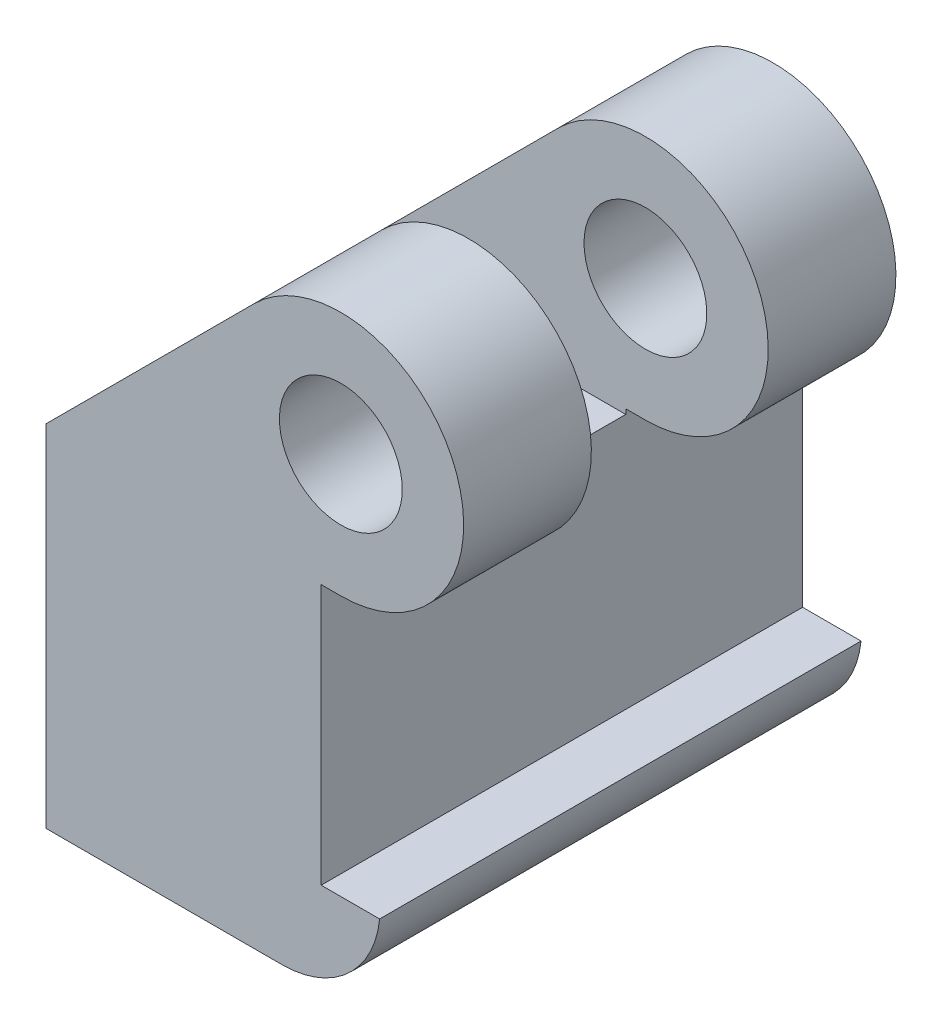
ISO-10303-21;
HEADER;
FILE_DESCRIPTION(('STEP AP214'),'2;1');
FILE_NAME('part.step','',(''),(''),'','','');
FILE_SCHEMA(('AUTOMOTIVE_DESIGN { 1 0 10303 214 1 1 1 1 }'));
ENDSEC;
DATA;
#1=APPLICATION_CONTEXT('core data for automotive mechanical design processes');
#2=APPLICATION_PROTOCOL_DEFINITION('international standard','automotive_design',2000,#1);
#3=PRODUCT_CONTEXT('',#1,'mechanical');
#4=PRODUCT('Part','Part','',(#3));
#5=PRODUCT_RELATED_PRODUCT_CATEGORY('part','',(#4));
#6=PRODUCT_DEFINITION_FORMATION('','',#4);
#7=PRODUCT_DEFINITION_CONTEXT('part definition',#1,'design');
#8=PRODUCT_DEFINITION('design','',#6,#7);
#9=PRODUCT_DEFINITION_SHAPE('','',#8);
#10=(LENGTH_UNIT() NAMED_UNIT(*) SI_UNIT(.MILLI.,.METRE.));
#11=(NAMED_UNIT(*) PLANE_ANGLE_UNIT() SI_UNIT($,.RADIAN.));
#12=(NAMED_UNIT(*) SI_UNIT($,.STERADIAN.) SOLID_ANGLE_UNIT());
#13=UNCERTAINTY_MEASURE_WITH_UNIT(LENGTH_MEASURE(1.E-05),#10,'distance_accuracy_value','');
#14=(GEOMETRIC_REPRESENTATION_CONTEXT(3) GLOBAL_UNCERTAINTY_ASSIGNED_CONTEXT((#13)) GLOBAL_UNIT_ASSIGNED_CONTEXT((#10,
#11,#12)) REPRESENTATION_CONTEXT('',''));
#15=CARTESIAN_POINT('',(0.,0.,0.));
#16=DIRECTION('',(0.,0.,1.));
#17=DIRECTION('',(1.,0.,0.));
#18=AXIS2_PLACEMENT_3D('',#15,#16,#17);
#19=CARTESIAN_POINT('',(-3.302,-7.112,5.08));
#20=DIRECTION('',(0.,1.,0.));
#21=DIRECTION('',(1.,0.,0.));
#22=AXIS2_PLACEMENT_3D('',#19,#20,#21);
#23=PLANE('',#22);
#24=DIRECTION('',(-1.,0.,0.));
#25=VECTOR('',#24,1.);
#26=CARTESIAN_POINT('',(-3.302,-7.112,5.08));
#27=LINE('',#26,#25);
#28=CARTESIAN_POINT('',(-4.572,-7.112,5.08));
#29=VERTEX_POINT('',#28);
#30=CARTESIAN_POINT('',(-7.62,-7.112,5.08));
#31=VERTEX_POINT('',#30);
#32=EDGE_CURVE('E537',#29,#31,#27,.T.);
#33=ORIENTED_EDGE('',*,*,#32,.T.);
#34=DIRECTION('',(0.,0.,-1.));
#35=VECTOR('',#34,1.);
#36=CARTESIAN_POINT('',(-7.62,-7.112,5.08));
#37=LINE('',#36,#35);
#38=CARTESIAN_POINT('',(-7.62,-7.112,3.556));
#39=VERTEX_POINT('',#38);
#40=EDGE_CURVE('E689',#31,#39,#37,.T.);
#41=ORIENTED_EDGE('',*,*,#40,.T.);
#42=DIRECTION('',(-1.,0.,0.));
#43=VECTOR('',#42,1.);
#44=CARTESIAN_POINT('',(-7.62,-7.11200000000001,3.556));
#45=LINE('',#44,#43);
#46=CARTESIAN_POINT('',(-6.0325,-7.11200000000001,3.556));
#47=VERTEX_POINT('',#46);
#48=EDGE_CURVE('E565',#47,#39,#45,.T.);
#49=ORIENTED_EDGE('',*,*,#48,.F.);
#50=CARTESIAN_POINT('',(-5.23875,-7.11200000000001,3.556));
#51=DIRECTION('',(0.,-1.,0.));
#52=DIRECTION('',(0.,0.,-1.));
#53=AXIS2_PLACEMENT_3D('',#50,#51,#52);
#54=CIRCLE('',#53,0.79375);
#55=CARTESIAN_POINT('',(-4.572,-7.11200000000001,3.98667795392845));
#56=VERTEX_POINT('',#55);
#57=EDGE_CURVE('E562',#56,#47,#54,.T.);
#58=ORIENTED_EDGE('',*,*,#57,.F.);
#59=DIRECTION('',(0.,0.,-1.));
#60=VECTOR('',#59,1.);
#61=CARTESIAN_POINT('',(-4.572,-7.112,5.08));
#62=LINE('',#61,#60);
#63=EDGE_CURVE('E706',#29,#56,#62,.T.);
#64=ORIENTED_EDGE('',*,*,#63,.F.);
#65=EDGE_LOOP('',(#33,#41,#49,#58,#64));
#66=FACE_BOUND('',#65,.T.);
#67=ADVANCED_FACE('F372',(#66),#23,.F.);
#68=CARTESIAN_POINT('',(-7.62,-5.842,5.08));
#69=DIRECTION('',(1.,0.,0.));
#70=DIRECTION('',(0.,-1.,0.));
#71=AXIS2_PLACEMENT_3D('',#68,#69,#70);
#72=PLANE('',#71);
#73=DIRECTION('',(0.,-1.,0.));
#74=VECTOR('',#73,1.);
#75=CARTESIAN_POINT('',(-7.62,-5.52450000000001,0.380999999999999));
#76=LINE('',#75,#74);
#77=CARTESIAN_POINT('',(-7.62,-5.52450000000001,0.380999999999999));
#78=VERTEX_POINT('',#77);
#79=CARTESIAN_POINT('',(-7.62,-7.11200000000001,0.380999999999999));
#80=VERTEX_POINT('',#79);
#81=EDGE_CURVE('E597',#78,#80,#76,.T.);
#82=ORIENTED_EDGE('',*,*,#81,.F.);
#83=DIRECTION('',(0.,0.,-1.));
#84=VECTOR('',#83,1.);
#85=CARTESIAN_POINT('',(-7.62,-5.52450000000001,3.556));
#86=LINE('',#85,#84);
#87=CARTESIAN_POINT('',(-7.62,-5.52450000000001,3.556));
#88=VERTEX_POINT('',#87);
#89=EDGE_CURVE('E568',#88,#78,#86,.T.);
#90=ORIENTED_EDGE('',*,*,#89,.F.);
#91=DIRECTION('',(0.,-1.,0.));
#92=VECTOR('',#91,1.);
#93=CARTESIAN_POINT('',(-7.62,-5.52450000000001,3.556));
#94=LINE('',#93,#92);
#95=EDGE_CURVE('E585',#88,#39,#94,.T.);
#96=ORIENTED_EDGE('',*,*,#95,.T.);
#97=ORIENTED_EDGE('',*,*,#40,.F.);
#98=DIRECTION('',(0.,1.,0.));
#99=VECTOR('',#98,1.);
#100=CARTESIAN_POINT('',(-7.62,-7.112,5.08));
#101=LINE('',#100,#99);
#102=CARTESIAN_POINT('',(-7.62,-2.58093596973274,5.08));
#103=VERTEX_POINT('',#102);
#104=EDGE_CURVE('E663',#31,#103,#101,.T.);
#105=ORIENTED_EDGE('',*,*,#104,.T.);
#106=DIRECTION('',(0.,0.,-1.));
#107=VECTOR('',#106,1.);
#108=CARTESIAN_POINT('',(-7.62,-2.58093596973274,5.08));
#109=LINE('',#108,#107);
#110=CARTESIAN_POINT('',(-7.62,-2.58093596973274,3.429));
#111=VERTEX_POINT('',#110);
#112=EDGE_CURVE('E685',#103,#111,#109,.T.);
#113=ORIENTED_EDGE('',*,*,#112,.T.);
#114=DIRECTION('',(0.,-1.,0.));
#115=VECTOR('',#114,1.);
#116=CARTESIAN_POINT('',(-7.62,-5.842,3.429));
#117=LINE('',#116,#115);
#118=CARTESIAN_POINT('',(-7.62,-2.667,3.429));
#119=VERTEX_POINT('',#118);
#120=EDGE_CURVE('E631',#111,#119,#117,.T.);
#121=ORIENTED_EDGE('',*,*,#120,.T.);
#122=DIRECTION('',(0.,0.,-1.));
#123=VECTOR('',#122,1.);
#124=CARTESIAN_POINT('',(-7.62,-2.667,5.08));
#125=LINE('',#124,#123);
#126=CARTESIAN_POINT('',(-7.62,-2.667,1.143));
#127=VERTEX_POINT('',#126);
#128=EDGE_CURVE('E692',#119,#127,#125,.T.);
#129=ORIENTED_EDGE('',*,*,#128,.T.);
#130=DIRECTION('',(0.,-1.,0.));
#131=VECTOR('',#130,1.);
#132=CARTESIAN_POINT('',(-7.62,-5.842,1.143));
#133=LINE('',#132,#131);
#134=CARTESIAN_POINT('',(-7.62,-2.58093596973274,1.143));
#135=VERTEX_POINT('',#134);
#136=EDGE_CURVE('E643',#135,#127,#133,.T.);
#137=ORIENTED_EDGE('',*,*,#136,.F.);
#138=CARTESIAN_POINT('',(-7.62,-2.58093596973274,-0.508));
#139=VERTEX_POINT('',#138);
#140=EDGE_CURVE('E684',#135,#139,#109,.T.);
#141=ORIENTED_EDGE('',*,*,#140,.T.);
#142=DIRECTION('',(0.,-1.,0.));
#143=VECTOR('',#142,1.);
#144=CARTESIAN_POINT('',(-7.62,-5.842,-0.508));
#145=LINE('',#144,#143);
#146=CARTESIAN_POINT('',(-7.62,-2.667,-0.508));
#147=VERTEX_POINT('',#146);
#148=EDGE_CURVE('E614',#139,#147,#145,.T.);
#149=ORIENTED_EDGE('',*,*,#148,.T.);
#150=DIRECTION('',(0.,0.,-1.));
#151=VECTOR('',#150,1.);
#152=CARTESIAN_POINT('',(-7.62,-2.667,5.08));
#153=LINE('',#152,#151);
#154=CARTESIAN_POINT('',(-7.62,-2.667,-1.143));
#155=VERTEX_POINT('',#154);
#156=EDGE_CURVE('E602',#147,#155,#153,.T.);
#157=ORIENTED_EDGE('',*,*,#156,.T.);
#158=DIRECTION('',(0.,1.,0.));
#159=VECTOR('',#158,1.);
#160=CARTESIAN_POINT('',(-7.62,-10.0622750118298,-1.143));
#161=LINE('',#160,#159);
#162=CARTESIAN_POINT('',(-7.62,-7.112,-1.143));
#163=VERTEX_POINT('',#162);
#164=EDGE_CURVE('E652',#163,#155,#161,.T.);
#165=ORIENTED_EDGE('',*,*,#164,.F.);
#166=EDGE_CURVE('E688',#80,#163,#37,.T.);
#167=ORIENTED_EDGE('',*,*,#166,.F.);
#168=EDGE_LOOP('',(#82,#90,#96,#97,#105,#113,#121,#129,#137,#141,#149,#157,#165,#167));
#169=FACE_BOUND('',#168,.T.);
#170=ADVANCED_FACE('F754',(#169),#72,.F.);
#171=CARTESIAN_POINT('',(-5.23875,-7.11200000000001,0.380999999999999));
#172=DIRECTION('',(0.,-1.,0.));
#173=DIRECTION('',(0.,0.,1.));
#174=AXIS2_PLACEMENT_3D('',#171,#172,#173);
#175=CIRCLE('',#174,0.79375);
#176=CARTESIAN_POINT('',(-6.0325,-7.11200000000001,0.380999999999999));
#177=VERTEX_POINT('',#176);
#178=CARTESIAN_POINT('',(-4.572,-7.11200000000001,-0.0496779539284517));
#179=VERTEX_POINT('',#178);
#180=EDGE_CURVE('E559',#177,#179,#175,.T.);
#181=ORIENTED_EDGE('',*,*,#180,.F.);
#182=DIRECTION('',(1.,0.,0.));
#183=VECTOR('',#182,1.);
#184=CARTESIAN_POINT('',(-6.0325,-7.11200000000001,0.380999999999999));
#185=LINE('',#184,#183);
#186=EDGE_CURVE('E543',#80,#177,#185,.T.);
#187=ORIENTED_EDGE('',*,*,#186,.F.);
#188=ORIENTED_EDGE('',*,*,#166,.T.);
#189=DIRECTION('',(-1.,0.,0.));
#190=VECTOR('',#189,1.);
#191=CARTESIAN_POINT('',(-3.302,-7.112,-1.143));
#192=LINE('',#191,#190);
#193=CARTESIAN_POINT('',(-4.572,-7.112,-1.143));
#194=VERTEX_POINT('',#193);
#195=EDGE_CURVE('E657',#194,#163,#192,.T.);
#196=ORIENTED_EDGE('',*,*,#195,.F.);
#197=DIRECTION('',(0.,0.,-1.));
#198=VECTOR('',#197,1.);
#199=CARTESIAN_POINT('',(-4.572,-7.112,5.08));
#200=LINE('',#199,#198);
#201=EDGE_CURVE('E701',#179,#194,#200,.T.);
#202=ORIENTED_EDGE('',*,*,#201,.F.);
#203=EDGE_LOOP('',(#181,#187,#188,#196,#202));
#204=FACE_BOUND('',#203,.T.);
#205=ADVANCED_FACE('F765',(#204),#23,.F.);
#206=CARTESIAN_POINT('',(-4.064,-4.318,5.08));
#207=DIRECTION('',(-1.,0.,0.));
#208=DIRECTION('',(0.,0.,1.));
#209=AXIS2_PLACEMENT_3D('',#206,#207,#208);
#210=PLANE('',#209);
#211=DIRECTION('',(0.,0.,1.));
#212=VECTOR('',#211,1.);
#213=CARTESIAN_POINT('',(-4.064,-2.667,5.08));
#214=LINE('',#213,#212);
#215=CARTESIAN_POINT('',(-4.064,-2.667,-1.143));
#216=VERTEX_POINT('',#215);
#217=CARTESIAN_POINT('',(-4.064,-2.667,-0.508));
#218=VERTEX_POINT('',#217);
#219=EDGE_CURVE('E605',#216,#218,#214,.T.);
#220=ORIENTED_EDGE('',*,*,#219,.T.);
#221=DIRECTION('',(0.,1.,0.));
#222=VECTOR('',#221,1.);
#223=CARTESIAN_POINT('',(-4.064,-4.318,-0.508));
#224=LINE('',#223,#222);
#225=CARTESIAN_POINT('',(-4.064,-2.6035,-0.508));
#226=VERTEX_POINT('',#225);
#227=EDGE_CURVE('E617',#218,#226,#224,.T.);
#228=ORIENTED_EDGE('',*,*,#227,.T.);
#229=DIRECTION('',(0.,0.,-1.));
#230=VECTOR('',#229,1.);
#231=CARTESIAN_POINT('',(-4.064,-2.6035,5.08));
#232=LINE('',#231,#230);
#233=CARTESIAN_POINT('',(-4.064,-2.6035,1.143));
#234=VERTEX_POINT('',#233);
#235=EDGE_CURVE('E674',#234,#226,#232,.T.);
#236=ORIENTED_EDGE('',*,*,#235,.F.);
#237=DIRECTION('',(0.,1.,0.));
#238=VECTOR('',#237,1.);
#239=CARTESIAN_POINT('',(-4.064,-4.318,1.143));
#240=LINE('',#239,#238);
#241=CARTESIAN_POINT('',(-4.064,-2.667,1.143));
#242=VERTEX_POINT('',#241);
#243=EDGE_CURVE('E646',#242,#234,#240,.T.);
#244=ORIENTED_EDGE('',*,*,#243,.F.);
#245=DIRECTION('',(0.,0.,1.));
#246=VECTOR('',#245,1.);
#247=CARTESIAN_POINT('',(-4.064,-2.667,5.08));
#248=LINE('',#247,#246);
#249=CARTESIAN_POINT('',(-4.064,-2.667,3.429));
#250=VERTEX_POINT('',#249);
#251=EDGE_CURVE('E649',#242,#250,#248,.T.);
#252=ORIENTED_EDGE('',*,*,#251,.T.);
#253=DIRECTION('',(0.,1.,0.));
#254=VECTOR('',#253,1.);
#255=CARTESIAN_POINT('',(-4.064,-4.318,3.429));
#256=LINE('',#255,#254);
#257=CARTESIAN_POINT('',(-4.064,-2.6035,3.429));
#258=VERTEX_POINT('',#257);
#259=EDGE_CURVE('E634',#250,#258,#256,.T.);
#260=ORIENTED_EDGE('',*,*,#259,.T.);
#261=CARTESIAN_POINT('',(-4.064,-2.6035,5.08));
#262=VERTEX_POINT('',#261);
#263=EDGE_CURVE('E535',#262,#258,#232,.T.);
#264=ORIENTED_EDGE('',*,*,#263,.F.);
#265=DIRECTION('',(0.,-1.,0.));
#266=VECTOR('',#265,1.);
#267=CARTESIAN_POINT('',(-4.064,-4.318,5.08));
#268=LINE('',#267,#266);
#269=CARTESIAN_POINT('',(-4.064,-5.969,5.08));
#270=VERTEX_POINT('',#269);
#271=EDGE_CURVE('E528',#262,#270,#268,.T.);
#272=ORIENTED_EDGE('',*,*,#271,.T.);
#273=DIRECTION('',(0.,0.,1.));
#274=VECTOR('',#273,1.);
#275=CARTESIAN_POINT('',(-4.064,-5.969,-1.143));
#276=LINE('',#275,#274);
#277=CARTESIAN_POINT('',(-4.064,-5.969,-1.143));
#278=VERTEX_POINT('',#277);
#279=EDGE_CURVE('E531',#278,#270,#276,.T.);
#280=ORIENTED_EDGE('',*,*,#279,.F.);
#281=DIRECTION('',(0.,-1.,0.));
#282=VECTOR('',#281,1.);
#283=CARTESIAN_POINT('',(-4.064,-4.318,-1.143));
#284=LINE('',#283,#282);
#285=EDGE_CURVE('E655',#216,#278,#284,.T.);
#286=ORIENTED_EDGE('',*,*,#285,.F.);
#287=EDGE_LOOP('',(#220,#228,#236,#244,#252,#260,#264,#272,#280,#286));
#288=FACE_BOUND('',#287,.T.);
#289=ADVANCED_FACE('F374',(#288),#210,.F.);
#290=CARTESIAN_POINT('',(-4.93253201513365,0.106532015133637,5.08));
#291=DIRECTION('',(0.707106781186551,-0.707106781186544,0.));
#292=DIRECTION('',(-0.707106781186544,-0.707106781186551,0.));
#293=AXIS2_PLACEMENT_3D('',#290,#291,#292);
#294=PLANE('',#293);
#295=DIRECTION('',(-0.707106781186544,-0.707106781186551,0.));
#296=VECTOR('',#295,1.);
#297=CARTESIAN_POINT('',(-4.93253201513365,0.106532015133637,-0.508));
#298=LINE('',#297,#296);
#299=CARTESIAN_POINT('',(-4.93253201513365,0.106532015133638,-0.508));
#300=VERTEX_POINT('',#299);
#301=EDGE_CURVE('E612',#300,#139,#298,.T.);
#302=ORIENTED_EDGE('',*,*,#301,.T.);
#303=ORIENTED_EDGE('',*,*,#140,.F.);
#304=DIRECTION('',(-0.707106781186544,-0.707106781186551,0.));
#305=VECTOR('',#304,1.);
#306=CARTESIAN_POINT('',(-4.93253201513365,0.106532015133637,1.143));
#307=LINE('',#306,#305);
#308=CARTESIAN_POINT('',(-4.93253201513365,0.106532015133638,1.143));
#309=VERTEX_POINT('',#308);
#310=EDGE_CURVE('E641',#309,#135,#307,.T.);
#311=ORIENTED_EDGE('',*,*,#310,.F.);
#312=DIRECTION('',(0.,0.,-1.));
#313=VECTOR('',#312,1.);
#314=CARTESIAN_POINT('',(-4.93253201513365,0.106532015133637,5.08));
#315=LINE('',#314,#313);
#316=EDGE_CURVE('E680',#309,#300,#315,.T.);
#317=ORIENTED_EDGE('',*,*,#316,.T.);
#318=EDGE_LOOP('',(#302,#303,#311,#317));
#319=FACE_BOUND('',#318,.T.);
#320=ADVANCED_FACE('F813',(#319),#294,.F.);
#321=CARTESIAN_POINT('',(-3.81,-1.016,5.08));
#322=DIRECTION('',(0.,0.,-1.));
#323=DIRECTION('',(-1.,0.,0.));
#324=AXIS2_PLACEMENT_3D('',#321,#322,#323);
#325=CYLINDRICAL_SURFACE('',#324,1.5875);
#326=CARTESIAN_POINT('',(-3.81,-1.016,-0.508));
#327=DIRECTION('',(0.,0.,1.));
#328=DIRECTION('',(-1.,0.,0.));
#329=AXIS2_PLACEMENT_3D('',#326,#327,#328);
#330=CIRCLE('',#329,1.5875);
#331=CARTESIAN_POINT('',(-3.81,-2.6035,-0.508));
#332=VERTEX_POINT('',#331);
#333=EDGE_CURVE('E610',#332,#300,#330,.T.);
#334=ORIENTED_EDGE('',*,*,#333,.T.);
#335=ORIENTED_EDGE('',*,*,#316,.F.);
#336=CARTESIAN_POINT('',(-3.81,-1.016,1.143));
#337=DIRECTION('',(0.,0.,1.));
#338=DIRECTION('',(0.,-1.,0.));
#339=AXIS2_PLACEMENT_3D('',#336,#337,#338);
#340=CIRCLE('',#339,1.5875);
#341=CARTESIAN_POINT('',(-3.81,-2.6035,1.143));
#342=VERTEX_POINT('',#341);
#343=EDGE_CURVE('E639',#342,#309,#340,.T.);
#344=ORIENTED_EDGE('',*,*,#343,.F.);
#345=DIRECTION('',(0.,0.,-1.));
#346=VECTOR('',#345,1.);
#347=CARTESIAN_POINT('',(-3.81,-2.6035,5.08));
#348=LINE('',#347,#346);
#349=EDGE_CURVE('E676',#342,#332,#348,.T.);
#350=ORIENTED_EDGE('',*,*,#349,.T.);
#351=EDGE_LOOP('',(#334,#335,#344,#350));
#352=FACE_BOUND('',#351,.T.);
#353=ADVANCED_FACE('F818',(#352),#325,.T.);
#354=CARTESIAN_POINT('',(-4.064,-2.6035,5.08));
#355=DIRECTION('',(0.,1.,0.));
#356=DIRECTION('',(0.,0.,-1.));
#357=AXIS2_PLACEMENT_3D('',#354,#355,#356);
#358=PLANE('',#357);
#359=DIRECTION('',(1.,0.,0.));
#360=VECTOR('',#359,1.);
#361=CARTESIAN_POINT('',(-4.064,-2.6035,-0.508));
#362=LINE('',#361,#360);
#363=EDGE_CURVE('E608',#226,#332,#362,.T.);
#364=ORIENTED_EDGE('',*,*,#363,.T.);
#365=ORIENTED_EDGE('',*,*,#349,.F.);
#366=DIRECTION('',(1.,0.,0.));
#367=VECTOR('',#366,1.);
#368=CARTESIAN_POINT('',(-4.064,-2.6035,1.143));
#369=LINE('',#368,#367);
#370=EDGE_CURVE('E637',#234,#342,#369,.T.);
#371=ORIENTED_EDGE('',*,*,#370,.F.);
#372=ORIENTED_EDGE('',*,*,#235,.T.);
#373=EDGE_LOOP('',(#364,#365,#371,#372));
#374=FACE_BOUND('',#373,.T.);
#375=ADVANCED_FACE('F784',(#374),#358,.F.);
#376=CARTESIAN_POINT('',(-3.81,-1.016,5.08));
#377=DIRECTION('',(0.,0.,-1.));
#378=DIRECTION('',(-1.,0.,0.));
#379=AXIS2_PLACEMENT_3D('',#376,#377,#378);
#380=CYLINDRICAL_SURFACE('',#379,0.793750000000003);
#381=CARTESIAN_POINT('',(-3.81,-1.016,1.143));
#382=DIRECTION('',(0.,0.,1.));
#383=DIRECTION('',(0.,-1.,0.));
#384=AXIS2_PLACEMENT_3D('',#381,#382,#383);
#385=CIRCLE('',#384,0.793750000000003);
#386=CARTESIAN_POINT('',(-3.81,-1.80975,1.143));
#387=VERTEX_POINT('',#386);
#388=EDGE_CURVE('E636',#387,#387,#385,.T.);
#389=ORIENTED_EDGE('',*,*,#388,.T.);
#390=EDGE_LOOP('',(#389));
#391=FACE_BOUND('',#390,.T.);
#392=CARTESIAN_POINT('',(-3.81,-1.016,-0.508));
#393=DIRECTION('',(0.,0.,1.));
#394=DIRECTION('',(-1.,0.,0.));
#395=AXIS2_PLACEMENT_3D('',#392,#393,#394);
#396=CIRCLE('',#395,0.793750000000003);
#397=CARTESIAN_POINT('',(-4.60375,-1.016,-0.508));
#398=VERTEX_POINT('',#397);
#399=EDGE_CURVE('E607',#398,#398,#396,.T.);
#400=ORIENTED_EDGE('',*,*,#399,.F.);
#401=EDGE_LOOP('',(#400));
#402=FACE_BOUND('',#401,.T.);
#403=ADVANCED_FACE('F825',(#391,#402),#380,.F.);
#404=CARTESIAN_POINT('',(-7.62,-10.0622750118298,-1.143));
#405=DIRECTION('',(0.,0.,1.));
#406=DIRECTION('',(0.,1.,0.));
#407=AXIS2_PLACEMENT_3D('',#404,#405,#406);
#408=PLANE('',#407);
#409=ORIENTED_EDGE('',*,*,#285,.T.);
#410=DIRECTION('',(1.,0.,0.));
#411=VECTOR('',#410,1.);
#412=CARTESIAN_POINT('',(-4.064,-5.969,-1.143));
#413=LINE('',#412,#411);
#414=CARTESIAN_POINT('',(-3.30836595487459,-5.969,-1.143));
#415=VERTEX_POINT('',#414);
#416=EDGE_CURVE('E542',#278,#415,#413,.T.);
#417=ORIENTED_EDGE('',*,*,#416,.T.);
#418=CARTESIAN_POINT('',(-4.572,-5.842,-1.143));
#419=DIRECTION('',(0.,0.,-1.));
#420=DIRECTION('',(0.,1.,0.));
#421=AXIS2_PLACEMENT_3D('',#418,#419,#420);
#422=CIRCLE('',#421,1.27);
#423=EDGE_CURVE('E744',#194,#415,#422,.F.);
#424=ORIENTED_EDGE('',*,*,#423,.F.);
#425=ORIENTED_EDGE('',*,*,#195,.T.);
#426=ORIENTED_EDGE('',*,*,#164,.T.);
#427=DIRECTION('',(1.,0.,0.));
#428=VECTOR('',#427,1.);
#429=CARTESIAN_POINT('',(-7.62,-2.667,-1.143));
#430=LINE('',#429,#428);
#431=EDGE_CURVE('E699',#155,#216,#430,.T.);
#432=ORIENTED_EDGE('',*,*,#431,.T.);
#433=EDGE_LOOP('',(#409,#417,#424,#425,#426,#432));
#434=FACE_BOUND('',#433,.T.);
#435=ADVANCED_FACE('F770',(#434),#408,.F.);
#436=DIRECTION('',(-0.707106781186544,-0.707106781186551,0.));
#437=VECTOR('',#436,1.);
#438=CARTESIAN_POINT('',(-4.93253201513365,0.106532015133637,3.429));
#439=LINE('',#438,#437);
#440=CARTESIAN_POINT('',(-4.93253201513365,0.106532015133638,3.429));
#441=VERTEX_POINT('',#440);
#442=EDGE_CURVE('E629',#441,#111,#439,.T.);
#443=ORIENTED_EDGE('',*,*,#442,.T.);
#444=ORIENTED_EDGE('',*,*,#112,.F.);
#445=DIRECTION('',(0.707106781186544,0.707106781186551,0.));
#446=VECTOR('',#445,1.);
#447=CARTESIAN_POINT('',(-4.93253201513365,0.106532015133637,5.08));
#448=LINE('',#447,#446);
#449=CARTESIAN_POINT('',(-4.93253201513365,0.106532015133637,5.08));
#450=VERTEX_POINT('',#449);
#451=EDGE_CURVE('E666',#103,#450,#448,.T.);
#452=ORIENTED_EDGE('',*,*,#451,.T.);
#453=EDGE_CURVE('E681',#450,#441,#315,.T.);
#454=ORIENTED_EDGE('',*,*,#453,.T.);
#455=EDGE_LOOP('',(#443,#444,#452,#454));
#456=FACE_BOUND('',#455,.T.);
#457=ADVANCED_FACE('F808',(#456),#294,.F.);
#458=CARTESIAN_POINT('',(-3.81,-1.016,3.429));
#459=DIRECTION('',(0.,0.,1.));
#460=DIRECTION('',(0.,-1.,0.));
#461=AXIS2_PLACEMENT_3D('',#458,#459,#460);
#462=CIRCLE('',#461,1.5875);
#463=CARTESIAN_POINT('',(-3.81,-2.6035,3.429));
#464=VERTEX_POINT('',#463);
#465=EDGE_CURVE('E627',#464,#441,#462,.T.);
#466=ORIENTED_EDGE('',*,*,#465,.T.);
#467=ORIENTED_EDGE('',*,*,#453,.F.);
#468=CARTESIAN_POINT('',(-3.81,-1.016,5.08));
#469=DIRECTION('',(0.,0.,-1.));
#470=DIRECTION('',(-1.,0.,0.));
#471=AXIS2_PLACEMENT_3D('',#468,#469,#470);
#472=CIRCLE('',#471,1.5875);
#473=CARTESIAN_POINT('',(-3.81,-2.6035,5.08));
#474=VERTEX_POINT('',#473);
#475=EDGE_CURVE('E669',#450,#474,#472,.T.);
#476=ORIENTED_EDGE('',*,*,#475,.T.);
#477=EDGE_CURVE('E677',#474,#464,#348,.T.);
#478=ORIENTED_EDGE('',*,*,#477,.T.);
#479=EDGE_LOOP('',(#466,#467,#476,#478));
#480=FACE_BOUND('',#479,.T.);
#481=ADVANCED_FACE('F806',(#480),#325,.T.);
#482=DIRECTION('',(1.,0.,0.));
#483=VECTOR('',#482,1.);
#484=CARTESIAN_POINT('',(-4.064,-2.6035,3.429));
#485=LINE('',#484,#483);
#486=EDGE_CURVE('E625',#258,#464,#485,.T.);
#487=ORIENTED_EDGE('',*,*,#486,.T.);
#488=ORIENTED_EDGE('',*,*,#477,.F.);
#489=DIRECTION('',(-1.,0.,0.));
#490=VECTOR('',#489,1.);
#491=CARTESIAN_POINT('',(-4.064,-2.6035,5.08));
#492=LINE('',#491,#490);
#493=EDGE_CURVE('E672',#474,#262,#492,.T.);
#494=ORIENTED_EDGE('',*,*,#493,.T.);
#495=ORIENTED_EDGE('',*,*,#263,.T.);
#496=EDGE_LOOP('',(#487,#488,#494,#495));
#497=FACE_BOUND('',#496,.T.);
#498=ADVANCED_FACE('F803',(#497),#358,.F.);
#499=CARTESIAN_POINT('',(-3.81,-1.016,5.08));
#500=DIRECTION('',(0.,0.,-1.));
#501=DIRECTION('',(1.,0.,0.));
#502=AXIS2_PLACEMENT_3D('',#499,#500,#501);
#503=CIRCLE('',#502,0.793750000000003);
#504=CARTESIAN_POINT('',(-3.01625,-1.016,5.08));
#505=VERTEX_POINT('',#504);
#506=EDGE_CURVE('E538',#505,#505,#503,.T.);
#507=ORIENTED_EDGE('',*,*,#506,.F.);
#508=EDGE_LOOP('',(#507));
#509=FACE_BOUND('',#508,.T.);
#510=CARTESIAN_POINT('',(-3.81,-1.016,3.429));
#511=DIRECTION('',(0.,0.,1.));
#512=DIRECTION('',(0.,-1.,0.));
#513=AXIS2_PLACEMENT_3D('',#510,#511,#512);
#514=CIRCLE('',#513,0.793750000000003);
#515=CARTESIAN_POINT('',(-3.81,-1.80975,3.429));
#516=VERTEX_POINT('',#515);
#517=EDGE_CURVE('E624',#516,#516,#514,.T.);
#518=ORIENTED_EDGE('',*,*,#517,.F.);
#519=EDGE_LOOP('',(#518));
#520=FACE_BOUND('',#519,.T.);
#521=ADVANCED_FACE('F862',(#509,#520),#380,.F.);
#522=CARTESIAN_POINT('',(-3.81,-1.016,5.08));
#523=DIRECTION('',(0.,0.,-1.));
#524=DIRECTION('',(-1.,0.,0.));
#525=AXIS2_PLACEMENT_3D('',#522,#523,#524);
#526=PLANE('',#525);
#527=DIRECTION('',(1.,0.,0.));
#528=VECTOR('',#527,1.);
#529=CARTESIAN_POINT('',(-4.064,-5.969,5.08));
#530=LINE('',#529,#528);
#531=CARTESIAN_POINT('',(-3.30836595487459,-5.969,5.08));
#532=VERTEX_POINT('',#531);
#533=EDGE_CURVE('E386',#270,#532,#530,.T.);
#534=ORIENTED_EDGE('',*,*,#533,.F.);
#535=ORIENTED_EDGE('',*,*,#271,.F.);
#536=ORIENTED_EDGE('',*,*,#493,.F.);
#537=ORIENTED_EDGE('',*,*,#475,.F.);
#538=ORIENTED_EDGE('',*,*,#451,.F.);
#539=ORIENTED_EDGE('',*,*,#104,.F.);
#540=ORIENTED_EDGE('',*,*,#32,.F.);
#541=CARTESIAN_POINT('',(-4.572,-5.842,5.08));
#542=DIRECTION('',(0.,0.,1.));
#543=DIRECTION('',(-1.,0.,0.));
#544=AXIS2_PLACEMENT_3D('',#541,#542,#543);
#545=CIRCLE('',#544,1.27);
#546=EDGE_CURVE('E380',#532,#29,#545,.F.);
#547=ORIENTED_EDGE('',*,*,#546,.F.);
#548=EDGE_LOOP('',(#534,#535,#536,#537,#538,#539,#540,#547));
#549=FACE_BOUND('',#548,.T.);
#550=ORIENTED_EDGE('',*,*,#506,.T.);
#551=EDGE_LOOP('',(#550));
#552=FACE_BOUND('',#551,.T.);
#553=ADVANCED_FACE('F546',(#549,#552),#526,.F.);
#554=CARTESIAN_POINT('',(-9.74051606002074,-2.667,1.143));
#555=DIRECTION('',(0.,1.,0.));
#556=DIRECTION('',(0.,0.,-1.));
#557=AXIS2_PLACEMENT_3D('',#554,#555,#556);
#558=PLANE('',#557);
#559=CARTESIAN_POINT('',(-5.715,-2.667,2.794));
#560=DIRECTION('',(0.,-1.,0.));
#561=DIRECTION('',(1.,0.,0.));
#562=AXIS2_PLACEMENT_3D('',#559,#560,#561);
#563=CIRCLE('',#562,0.508000000000001);
#564=CARTESIAN_POINT('',(-5.207,-2.667,2.794));
#565=VERTEX_POINT('',#564);
#566=EDGE_CURVE('E553',#565,#565,#563,.F.);
#567=ORIENTED_EDGE('',*,*,#566,.F.);
#568=EDGE_LOOP('',(#567));
#569=FACE_BOUND('',#568,.T.);
#570=ORIENTED_EDGE('',*,*,#251,.F.);
#571=DIRECTION('',(1.,0.,0.));
#572=VECTOR('',#571,1.);
#573=CARTESIAN_POINT('',(-9.74051606002074,-2.667,1.143));
#574=LINE('',#573,#572);
#575=EDGE_CURVE('E622',#127,#242,#574,.T.);
#576=ORIENTED_EDGE('',*,*,#575,.F.);
#577=ORIENTED_EDGE('',*,*,#128,.F.);
#578=DIRECTION('',(1.,0.,0.));
#579=VECTOR('',#578,1.);
#580=CARTESIAN_POINT('',(-9.74051606002074,-2.667,3.429));
#581=LINE('',#580,#579);
#582=EDGE_CURVE('E620',#119,#250,#581,.T.);
#583=ORIENTED_EDGE('',*,*,#582,.T.);
#584=EDGE_LOOP('',(#570,#576,#577,#583));
#585=FACE_BOUND('',#584,.T.);
#586=ADVANCED_FACE('F794',(#569,#585),#558,.T.);
#587=CARTESIAN_POINT('',(-9.74051606002074,-2.667,1.143));
#588=DIRECTION('',(0.,0.,-1.));
#589=DIRECTION('',(0.,-1.,0.));
#590=AXIS2_PLACEMENT_3D('',#587,#588,#589);
#591=PLANE('',#590);
#592=ORIENTED_EDGE('',*,*,#388,.F.);
#593=EDGE_LOOP('',(#592));
#594=FACE_BOUND('',#593,.T.);
#595=ORIENTED_EDGE('',*,*,#575,.T.);
#596=ORIENTED_EDGE('',*,*,#243,.T.);
#597=ORIENTED_EDGE('',*,*,#370,.T.);
#598=ORIENTED_EDGE('',*,*,#343,.T.);
#599=ORIENTED_EDGE('',*,*,#310,.T.);
#600=ORIENTED_EDGE('',*,*,#136,.T.);
#601=EDGE_LOOP('',(#595,#596,#597,#598,#599,#600));
#602=FACE_BOUND('',#601,.T.);
#603=ADVANCED_FACE('F789',(#594,#602),#591,.F.);
#604=CARTESIAN_POINT('',(-9.74051606002074,-2.667,3.429));
#605=DIRECTION('',(0.,0.,-1.));
#606=DIRECTION('',(0.,-1.,0.));
#607=AXIS2_PLACEMENT_3D('',#604,#605,#606);
#608=PLANE('',#607);
#609=ORIENTED_EDGE('',*,*,#517,.T.);
#610=EDGE_LOOP('',(#609));
#611=FACE_BOUND('',#610,.T.);
#612=ORIENTED_EDGE('',*,*,#259,.F.);
#613=ORIENTED_EDGE('',*,*,#582,.F.);
#614=ORIENTED_EDGE('',*,*,#120,.F.);
#615=ORIENTED_EDGE('',*,*,#442,.F.);
#616=ORIENTED_EDGE('',*,*,#465,.F.);
#617=ORIENTED_EDGE('',*,*,#486,.F.);
#618=EDGE_LOOP('',(#612,#613,#614,#615,#616,#617));
#619=FACE_BOUND('',#618,.T.);
#620=ADVANCED_FACE('F797',(#611,#619),#608,.T.);
#621=CARTESIAN_POINT('',(-12.5598636984989,-2.667,-0.508));
#622=DIRECTION('',(0.,0.,-1.));
#623=DIRECTION('',(-1.,0.,0.));
#624=AXIS2_PLACEMENT_3D('',#621,#622,#623);
#625=PLANE('',#624);
#626=ORIENTED_EDGE('',*,*,#399,.T.);
#627=EDGE_LOOP('',(#626));
#628=FACE_BOUND('',#627,.T.);
#629=ORIENTED_EDGE('',*,*,#227,.F.);
#630=DIRECTION('',(-1.,0.,0.));
#631=VECTOR('',#630,1.);
#632=CARTESIAN_POINT('',(-12.5598636984989,-2.667,-0.508));
#633=LINE('',#632,#631);
#634=EDGE_CURVE('E600',#218,#147,#633,.T.);
#635=ORIENTED_EDGE('',*,*,#634,.T.);
#636=ORIENTED_EDGE('',*,*,#148,.F.);
#637=ORIENTED_EDGE('',*,*,#301,.F.);
#638=ORIENTED_EDGE('',*,*,#333,.F.);
#639=ORIENTED_EDGE('',*,*,#363,.F.);
#640=EDGE_LOOP('',(#629,#635,#636,#637,#638,#639));
#641=FACE_BOUND('',#640,.T.);
#642=ADVANCED_FACE('F778',(#628,#641),#625,.T.);
#643=CARTESIAN_POINT('',(-12.5598636984989,-2.667,-0.508));
#644=DIRECTION('',(0.,1.,0.));
#645=DIRECTION('',(0.,0.,-1.));
#646=AXIS2_PLACEMENT_3D('',#643,#644,#645);
#647=PLANE('',#646);
#648=ORIENTED_EDGE('',*,*,#219,.F.);
#649=ORIENTED_EDGE('',*,*,#431,.F.);
#650=ORIENTED_EDGE('',*,*,#156,.F.);
#651=ORIENTED_EDGE('',*,*,#634,.F.);
#652=EDGE_LOOP('',(#648,#649,#650,#651));
#653=FACE_BOUND('',#652,.T.);
#654=ADVANCED_FACE('F773',(#653),#647,.T.);
#655=CARTESIAN_POINT('',(-6.0325,-5.52450000000001,0.380999999999999));
#656=DIRECTION('',(0.,0.,1.));
#657=DIRECTION('',(1.,0.,0.));
#658=AXIS2_PLACEMENT_3D('',#655,#656,#657);
#659=PLANE('',#658);
#660=ORIENTED_EDGE('',*,*,#186,.T.);
#661=DIRECTION('',(0.,-1.,0.));
#662=VECTOR('',#661,1.);
#663=CARTESIAN_POINT('',(-6.0325,-5.52450000000001,0.380999999999999));
#664=LINE('',#663,#662);
#665=CARTESIAN_POINT('',(-6.0325,-5.52450000000001,0.380999999999999));
#666=VERTEX_POINT('',#665);
#667=EDGE_CURVE('E595',#666,#177,#664,.T.);
#668=ORIENTED_EDGE('',*,*,#667,.F.);
#669=DIRECTION('',(1.,0.,0.));
#670=VECTOR('',#669,1.);
#671=CARTESIAN_POINT('',(-6.0325,-5.52450000000001,0.380999999999999));
#672=LINE('',#671,#670);
#673=EDGE_CURVE('E571',#78,#666,#672,.T.);
#674=ORIENTED_EDGE('',*,*,#673,.F.);
#675=ORIENTED_EDGE('',*,*,#81,.T.);
#676=EDGE_LOOP('',(#660,#668,#674,#675));
#677=FACE_BOUND('',#676,.T.);
#678=ADVANCED_FACE('F736',(#677),#659,.T.);
#679=CARTESIAN_POINT('',(-5.23875,-5.52450000000001,0.380999999999999));
#680=DIRECTION('',(0.,-1.,0.));
#681=DIRECTION('',(0.,0.,1.));
#682=AXIS2_PLACEMENT_3D('',#679,#680,#681);
#683=CYLINDRICAL_SURFACE('',#682,0.79375);
#684=DIRECTION('',(0.,-1.,0.));
#685=VECTOR('',#684,1.);
#686=CARTESIAN_POINT('',(-4.445,-5.52450000000001,0.381));
#687=LINE('',#686,#685);
#688=CARTESIAN_POINT('',(-4.445,-5.52450000000001,0.381));
#689=VERTEX_POINT('',#688);
#690=CARTESIAN_POINT('',(-4.445,-7.10563404512541,0.381));
#691=VERTEX_POINT('',#690);
#692=EDGE_CURVE('E592',#689,#691,#687,.T.);
#693=ORIENTED_EDGE('',*,*,#692,.F.);
#694=CARTESIAN_POINT('',(-5.23875,-5.52450000000001,0.380999999999999));
#695=DIRECTION('',(0.,-1.,0.));
#696=DIRECTION('',(0.,0.,1.));
#697=AXIS2_PLACEMENT_3D('',#694,#695,#696);
#698=CIRCLE('',#697,0.79375);
#699=EDGE_CURVE('E574',#666,#689,#698,.T.);
#700=ORIENTED_EDGE('',*,*,#699,.F.);
#701=ORIENTED_EDGE('',*,*,#667,.T.);
#702=ORIENTED_EDGE('',*,*,#180,.T.);
#703=CARTESIAN_POINT('',(-4.445,-7.10563404512541,0.381));
#704=CARTESIAN_POINT('',(-4.4450004844147,-7.1056303984611,0.358432712776229));
#705=CARTESIAN_POINT('',(-4.44596314345864,-7.10573119218662,0.335878264804764));
#706=CARTESIAN_POINT('',(-4.44980362418333,-7.10610983616957,0.290932120872655));
#707=CARTESIAN_POINT('',(-4.45268164704677,-7.10638770502618,0.268540442258489));
#708=CARTESIAN_POINT('',(-4.46398707984517,-7.10742197914101,0.20291134432807));
#709=CARTESIAN_POINT('',(-4.47508907259905,-7.108382166006,0.160101395344258));
#710=CARTESIAN_POINT('',(-4.49990752710999,-7.10999309940195,0.0892520952039484));
#711=CARTESIAN_POINT('',(-4.51188411163495,-7.11065150157677,0.060583768348125));
#712=CARTESIAN_POINT('',(-4.53933571140463,-7.11165338955345,0.00436429271292559));
#713=CARTESIAN_POINT('',(-4.55486662679033,-7.11199134371151,-0.0231596546023797));
#714=CARTESIAN_POINT('',(-4.572,-7.112,-0.0496779539284517));
#715=B_SPLINE_CURVE_WITH_KNOTS('',3,(#703,#704,#705,#706,#707,#708,#709,#710,#711,#712,#713,
#714),.UNSPECIFIED.,.F.,.F.,(4,2,2,2,2,4),(0.,0.0676557001479344,0.135318507720486,
0.267330864658574,0.360364182095196,0.454975697212423),.UNSPECIFIED.);
#716=EDGE_CURVE('E739',#691,#179,#715,.T.);
#717=ORIENTED_EDGE('',*,*,#716,.F.);
#718=EDGE_LOOP('',(#693,#700,#701,#702,#717));
#719=FACE_BOUND('',#718,.T.);
#720=ADVANCED_FACE('F731',(#719),#683,.F.);
#721=CARTESIAN_POINT('',(-4.445,-5.52450000000001,3.556));
#722=DIRECTION('',(-1.,0.,0.));
#723=DIRECTION('',(0.,0.,1.));
#724=AXIS2_PLACEMENT_3D('',#721,#722,#723);
#725=PLANE('',#724);
#726=DIRECTION('',(0.,-1.,0.));
#727=VECTOR('',#726,1.);
#728=CARTESIAN_POINT('',(-4.445,-5.52450000000001,3.556));
#729=LINE('',#728,#727);
#730=CARTESIAN_POINT('',(-4.445,-5.52450000000001,3.556));
#731=VERTEX_POINT('',#730);
#732=CARTESIAN_POINT('',(-4.445,-7.10563404512541,3.556));
#733=VERTEX_POINT('',#732);
#734=EDGE_CURVE('E589',#731,#733,#729,.T.);
#735=ORIENTED_EDGE('',*,*,#734,.F.);
#736=DIRECTION('',(0.,0.,1.));
#737=VECTOR('',#736,1.);
#738=CARTESIAN_POINT('',(-4.445,-5.52450000000001,3.556));
#739=LINE('',#738,#737);
#740=EDGE_CURVE('E577',#689,#731,#739,.T.);
#741=ORIENTED_EDGE('',*,*,#740,.F.);
#742=ORIENTED_EDGE('',*,*,#692,.T.);
#743=DIRECTION('',(0.,0.,-1.));
#744=VECTOR('',#743,1.);
#745=CARTESIAN_POINT('',(-4.445,-7.10563404512541,3.556));
#746=LINE('',#745,#744);
#747=EDGE_CURVE('E394',#733,#691,#746,.T.);
#748=ORIENTED_EDGE('',*,*,#747,.F.);
#749=EDGE_LOOP('',(#735,#741,#742,#748));
#750=FACE_BOUND('',#749,.T.);
#751=ADVANCED_FACE('F727',(#750),#725,.T.);
#752=CARTESIAN_POINT('',(-5.23875,-5.52450000000001,3.556));
#753=DIRECTION('',(0.,-1.,0.));
#754=DIRECTION('',(0.,0.,1.));
#755=AXIS2_PLACEMENT_3D('',#752,#753,#754);
#756=CYLINDRICAL_SURFACE('',#755,0.79375);
#757=ORIENTED_EDGE('',*,*,#57,.T.);
#758=DIRECTION('',(0.,-1.,0.));
#759=VECTOR('',#758,1.);
#760=CARTESIAN_POINT('',(-6.0325,-5.52450000000001,3.556));
#761=LINE('',#760,#759);
#762=CARTESIAN_POINT('',(-6.0325,-5.52450000000001,3.556));
#763=VERTEX_POINT('',#762);
#764=EDGE_CURVE('E587',#763,#47,#761,.T.);
#765=ORIENTED_EDGE('',*,*,#764,.F.);
#766=CARTESIAN_POINT('',(-5.23875,-5.52450000000001,3.556));
#767=DIRECTION('',(0.,-1.,0.));
#768=DIRECTION('',(0.,0.,-1.));
#769=AXIS2_PLACEMENT_3D('',#766,#767,#768);
#770=CIRCLE('',#769,0.79375);
#771=EDGE_CURVE('E580',#731,#763,#770,.T.);
#772=ORIENTED_EDGE('',*,*,#771,.F.);
#773=ORIENTED_EDGE('',*,*,#734,.T.);
#774=CARTESIAN_POINT('',(-4.572,-7.11200000000001,3.98667795392845));
#775=CARTESIAN_POINT('',(-4.55975473654474,-7.11199834180669,3.96771952195727));
#776=CARTESIAN_POINT('',(-4.54832541319857,-7.11182315421195,3.94825097980385));
#777=CARTESIAN_POINT('',(-4.52716436625746,-7.1112527310161,3.90841242849842));
#778=CARTESIAN_POINT('',(-4.5174328228752,-7.11085747207392,3.88804232393644));
#779=CARTESIAN_POINT('',(-4.49132102724222,-7.10955388337107,3.82678205037969));
#780=CARTESIAN_POINT('',(-4.47741861997623,-7.10851508677905,3.78479935094274));
#781=CARTESIAN_POINT('',(-4.45982401040781,-7.1070575588903,3.71181777698968));
#782=CARTESIAN_POINT('',(-4.45432904009917,-7.10654630750175,3.681236451022));
#783=CARTESIAN_POINT('',(-4.44688416128013,-7.10582356912731,3.61911557255955));
#784=CARTESIAN_POINT('',(-4.44499593852661,-7.10561731158198,3.58756856460095));
#785=CARTESIAN_POINT('',(-4.445,-7.10563404512541,3.556));
#786=B_SPLINE_CURVE_WITH_KNOTS('',3,(#774,#775,#776,#777,#778,#779,#780,#781,#782,#783,#784,
#785),.UNSPECIFIED.,.F.,.F.,(4,2,2,2,2,4),(0.,0.0676590658994291,0.135325309179528,
0.267339579895295,0.36036914837765,0.454976022818294),.UNSPECIFIED.);
#787=EDGE_CURVE('E709',#56,#733,#786,.T.);
#788=ORIENTED_EDGE('',*,*,#787,.F.);
#789=EDGE_LOOP('',(#757,#765,#772,#773,#788));
#790=FACE_BOUND('',#789,.T.);
#791=ADVANCED_FACE('F721',(#790),#756,.F.);
#792=CARTESIAN_POINT('',(-7.62,-5.52450000000001,3.556));
#793=DIRECTION('',(0.,0.,-1.));
#794=DIRECTION('',(-1.,0.,0.));
#795=AXIS2_PLACEMENT_3D('',#792,#793,#794);
#796=PLANE('',#795);
#797=ORIENTED_EDGE('',*,*,#48,.T.);
#798=ORIENTED_EDGE('',*,*,#95,.F.);
#799=DIRECTION('',(-1.,0.,0.));
#800=VECTOR('',#799,1.);
#801=CARTESIAN_POINT('',(-7.62,-5.52450000000001,3.556));
#802=LINE('',#801,#800);
#803=EDGE_CURVE('E583',#763,#88,#802,.T.);
#804=ORIENTED_EDGE('',*,*,#803,.F.);
#805=ORIENTED_EDGE('',*,*,#764,.T.);
#806=EDGE_LOOP('',(#797,#798,#804,#805));
#807=FACE_BOUND('',#806,.T.);
#808=ADVANCED_FACE('F726',(#807),#796,.T.);
#809=CARTESIAN_POINT('',(-5.23875,-5.52450000000001,0.380999999999999));
#810=DIRECTION('',(0.,-1.,0.));
#811=DIRECTION('',(0.,0.,1.));
#812=AXIS2_PLACEMENT_3D('',#809,#810,#811);
#813=PLANE('',#812);
#814=ORIENTED_EDGE('',*,*,#89,.T.);
#815=ORIENTED_EDGE('',*,*,#673,.T.);
#816=ORIENTED_EDGE('',*,*,#699,.T.);
#817=ORIENTED_EDGE('',*,*,#740,.T.);
#818=ORIENTED_EDGE('',*,*,#771,.T.);
#819=ORIENTED_EDGE('',*,*,#803,.T.);
#820=EDGE_LOOP('',(#814,#815,#816,#817,#818,#819));
#821=FACE_BOUND('',#820,.T.);
#822=ADVANCED_FACE('F847',(#821),#813,.T.);
#823=CARTESIAN_POINT('',(-4.572,-5.842,5.08));
#824=DIRECTION('',(0.,0.,-1.));
#825=DIRECTION('',(-1.,0.,0.));
#826=AXIS2_PLACEMENT_3D('',#823,#824,#825);
#827=CYLINDRICAL_SURFACE('',#826,1.27);
#828=DIRECTION('',(0.,0.,-1.));
#829=VECTOR('',#828,1.);
#830=CARTESIAN_POINT('',(-3.30836595487459,-5.969,5.08));
#831=LINE('',#830,#829);
#832=EDGE_CURVE('E11',#532,#415,#831,.T.);
#833=ORIENTED_EDGE('',*,*,#832,.F.);
#834=ORIENTED_EDGE('',*,*,#546,.T.);
#835=ORIENTED_EDGE('',*,*,#63,.T.);
#836=ORIENTED_EDGE('',*,*,#787,.T.);
#837=ORIENTED_EDGE('',*,*,#747,.T.);
#838=ORIENTED_EDGE('',*,*,#716,.T.);
#839=ORIENTED_EDGE('',*,*,#201,.T.);
#840=ORIENTED_EDGE('',*,*,#423,.T.);
#841=EDGE_LOOP('',(#833,#834,#835,#836,#837,#838,#839,#840));
#842=FACE_BOUND('',#841,.T.);
#843=ADVANCED_FACE('F717',(#842),#827,.T.);
#844=CARTESIAN_POINT('',(-4.064,-5.969,-1.143));
#845=DIRECTION('',(0.,-1.,0.));
#846=DIRECTION('',(0.,0.,-1.));
#847=AXIS2_PLACEMENT_3D('',#844,#845,#846);
#848=PLANE('',#847);
#849=ORIENTED_EDGE('',*,*,#832,.T.);
#850=ORIENTED_EDGE('',*,*,#416,.F.);
#851=ORIENTED_EDGE('',*,*,#279,.T.);
#852=ORIENTED_EDGE('',*,*,#533,.T.);
#853=EDGE_LOOP('',(#849,#850,#851,#852));
#854=FACE_BOUND('',#853,.T.);
#855=ADVANCED_FACE('F540',(#854),#848,.F.);
#856=CARTESIAN_POINT('',(-5.715,-4.572,2.794));
#857=DIRECTION('',(0.,1.,0.));
#858=DIRECTION('',(-1.,0.,0.));
#859=AXIS2_PLACEMENT_3D('',#856,#857,#858);
#860=CYLINDRICAL_SURFACE('',#859,0.508000000000001);
#861=CARTESIAN_POINT('',(-5.715,-4.572,2.794));
#862=DIRECTION('',(0.,-1.,0.));
#863=DIRECTION('',(1.,0.,0.));
#864=AXIS2_PLACEMENT_3D('',#861,#862,#863);
#865=CIRCLE('',#864,0.508000000000001);
#866=CARTESIAN_POINT('',(-5.207,-4.572,2.794));
#867=VERTEX_POINT('',#866);
#868=EDGE_CURVE('E549',#867,#867,#865,.F.);
#869=ORIENTED_EDGE('',*,*,#868,.F.);
#870=EDGE_LOOP('',(#869));
#871=FACE_BOUND('',#870,.T.);
#872=ORIENTED_EDGE('',*,*,#566,.T.);
#873=EDGE_LOOP('',(#872));
#874=FACE_BOUND('',#873,.T.);
#875=ADVANCED_FACE('F874',(#871,#874),#860,.F.);
#876=CARTESIAN_POINT('',(-5.842,-4.572,-1.1435688377229));
#877=DIRECTION('',(0.,-1.,0.));
#878=DIRECTION('',(1.,0.,0.));
#879=AXIS2_PLACEMENT_3D('',#876,#877,#878);
#880=PLANE('',#879);
#881=ORIENTED_EDGE('',*,*,#868,.T.);
#882=EDGE_LOOP('',(#881));
#883=FACE_BOUND('',#882,.T.);
#884=ADVANCED_FACE('F887',(#883),#880,.F.);
#885=CLOSED_SHELL('',(#67,#170,#205,#289,#320,#353,#375,#403,#435,#457,#481,#498,#521,#553,#586,
#603,#620,#642,#654,#678,#720,#751,#791,#808,#822,#843,#855,#875,#884));
#886=MANIFOLD_SOLID_BREP('B2',#885);
#887=ADVANCED_BREP_SHAPE_REPRESENTATION('',(#18,#886),#14);
#888=SHAPE_DEFINITION_REPRESENTATION(#9,#887);
ENDSEC;
END-ISO-10303-21;
